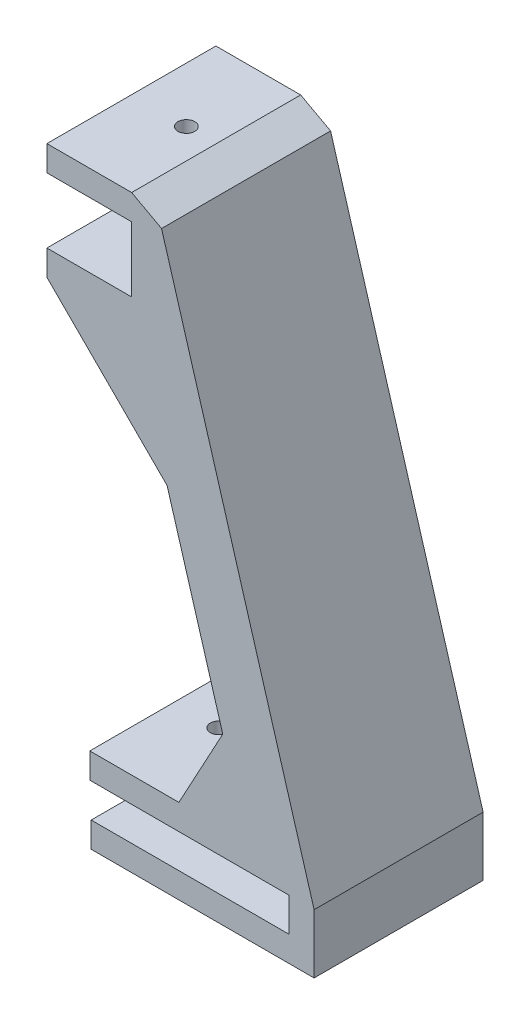
ISO-10303-21;
HEADER;
FILE_DESCRIPTION(('STEP AP214'),'2;1');
FILE_NAME('part.step','',(''),(''),'','','');
FILE_SCHEMA(('AUTOMOTIVE_DESIGN { 1 0 10303 214 1 1 1 1 }'));
ENDSEC;
DATA;
#1=APPLICATION_CONTEXT('core data for automotive mechanical design processes');
#2=APPLICATION_PROTOCOL_DEFINITION('international standard','automotive_design',2000,#1);
#3=PRODUCT_CONTEXT('',#1,'mechanical');
#4=PRODUCT('Part','Part','',(#3));
#5=PRODUCT_RELATED_PRODUCT_CATEGORY('part','',(#4));
#6=PRODUCT_DEFINITION_FORMATION('','',#4);
#7=PRODUCT_DEFINITION_CONTEXT('part definition',#1,'design');
#8=PRODUCT_DEFINITION('design','',#6,#7);
#9=PRODUCT_DEFINITION_SHAPE('','',#8);
#10=(LENGTH_UNIT() NAMED_UNIT(*) SI_UNIT(.MILLI.,.METRE.));
#11=(NAMED_UNIT(*) PLANE_ANGLE_UNIT() SI_UNIT($,.RADIAN.));
#12=(NAMED_UNIT(*) SI_UNIT($,.STERADIAN.) SOLID_ANGLE_UNIT());
#13=UNCERTAINTY_MEASURE_WITH_UNIT(LENGTH_MEASURE(1.E-05),#10,'distance_accuracy_value','');
#14=(GEOMETRIC_REPRESENTATION_CONTEXT(3) GLOBAL_UNCERTAINTY_ASSIGNED_CONTEXT((#13)) GLOBAL_UNIT_ASSIGNED_CONTEXT((#10,
#11,#12)) REPRESENTATION_CONTEXT('',''));
#15=CARTESIAN_POINT('',(0.,0.,0.));
#16=DIRECTION('',(0.,0.,1.));
#17=DIRECTION('',(1.,0.,0.));
#18=AXIS2_PLACEMENT_3D('',#15,#16,#17);
#19=CARTESIAN_POINT('',(0.,0.,20.));
#20=DIRECTION('',(1.,0.,0.));
#21=DIRECTION('',(0.,1.,0.));
#22=AXIS2_PLACEMENT_3D('',#19,#20,#21);
#23=PLANE('',#22);
#24=DIRECTION('',(0.,-1.,0.));
#25=VECTOR('',#24,1.);
#26=CARTESIAN_POINT('',(0.,0.,0.));
#27=LINE('',#26,#25);
#28=CARTESIAN_POINT('',(0.,0.,0.));
#29=VERTEX_POINT('',#28);
#30=CARTESIAN_POINT('',(0.,-3.,0.));
#31=VERTEX_POINT('',#30);
#32=EDGE_CURVE('E187',#29,#31,#27,.T.);
#33=ORIENTED_EDGE('',*,*,#32,.T.);
#34=DIRECTION('',(0.,0.,-1.));
#35=VECTOR('',#34,1.);
#36=CARTESIAN_POINT('',(0.,-3.,20.));
#37=LINE('',#36,#35);
#38=CARTESIAN_POINT('',(0.,-3.,20.));
#39=VERTEX_POINT('',#38);
#40=EDGE_CURVE('E168',#39,#31,#37,.T.);
#41=ORIENTED_EDGE('',*,*,#40,.F.);
#42=DIRECTION('',(0.,-1.,0.));
#43=VECTOR('',#42,1.);
#44=CARTESIAN_POINT('',(0.,0.,20.));
#45=LINE('',#44,#43);
#46=CARTESIAN_POINT('',(0.,0.,20.));
#47=VERTEX_POINT('',#46);
#48=EDGE_CURVE('E175',#47,#39,#45,.T.);
#49=ORIENTED_EDGE('',*,*,#48,.F.);
#50=DIRECTION('',(0.,0.,-1.));
#51=VECTOR('',#50,1.);
#52=CARTESIAN_POINT('',(0.,0.,20.));
#53=LINE('',#52,#51);
#54=EDGE_CURVE('E264',#47,#29,#53,.T.);
#55=ORIENTED_EDGE('',*,*,#54,.T.);
#56=EDGE_LOOP('',(#33,#41,#49,#55));
#57=FACE_BOUND('',#56,.T.);
#58=ADVANCED_FACE('F33',(#57),#23,.F.);
#59=CARTESIAN_POINT('',(0.,-3.,20.));
#60=DIRECTION('',(0.,1.,0.));
#61=DIRECTION('',(0.,0.,1.));
#62=AXIS2_PLACEMENT_3D('',#59,#60,#61);
#63=PLANE('',#62);
#64=CARTESIAN_POINT('',(5.10406737319468,-3.,10.));
#65=DIRECTION('',(0.,1.,0.));
#66=DIRECTION('',(0.,0.,1.));
#67=AXIS2_PLACEMENT_3D('',#64,#65,#66);
#68=CIRCLE('',#67,1.);
#69=CARTESIAN_POINT('',(5.10406737319468,-3.,11.));
#70=VERTEX_POINT('',#69);
#71=EDGE_CURVE('E336',#70,#70,#68,.T.);
#72=ORIENTED_EDGE('',*,*,#71,.T.);
#73=EDGE_LOOP('',(#72));
#74=FACE_BOUND('',#73,.T.);
#75=DIRECTION('',(1.,0.,0.));
#76=VECTOR('',#75,1.);
#77=CARTESIAN_POINT('',(0.,-3.,0.));
#78=LINE('',#77,#76);
#79=CARTESIAN_POINT('',(26.3770268734246,-3.,0.));
#80=VERTEX_POINT('',#79);
#81=EDGE_CURVE('E300',#31,#80,#78,.T.);
#82=ORIENTED_EDGE('',*,*,#81,.T.);
#83=DIRECTION('',(0.,0.,-1.));
#84=VECTOR('',#83,1.);
#85=CARTESIAN_POINT('',(26.3770268734246,-3.,20.));
#86=LINE('',#85,#84);
#87=CARTESIAN_POINT('',(26.3770268734246,-3.,20.));
#88=VERTEX_POINT('',#87);
#89=EDGE_CURVE('E171',#88,#80,#86,.T.);
#90=ORIENTED_EDGE('',*,*,#89,.F.);
#91=DIRECTION('',(1.,0.,0.));
#92=VECTOR('',#91,1.);
#93=CARTESIAN_POINT('',(0.,-3.,20.));
#94=LINE('',#93,#92);
#95=EDGE_CURVE('E164',#39,#88,#94,.T.);
#96=ORIENTED_EDGE('',*,*,#95,.F.);
#97=ORIENTED_EDGE('',*,*,#40,.T.);
#98=EDGE_LOOP('',(#82,#90,#96,#97));
#99=FACE_BOUND('',#98,.T.);
#100=ADVANCED_FACE('F166',(#74,#99),#63,.F.);
#101=CARTESIAN_POINT('',(26.3770268734246,-3.,20.));
#102=DIRECTION('',(-1.,0.,0.));
#103=DIRECTION('',(0.,0.,1.));
#104=AXIS2_PLACEMENT_3D('',#101,#102,#103);
#105=PLANE('',#104);
#106=DIRECTION('',(0.,1.,0.));
#107=VECTOR('',#106,1.);
#108=CARTESIAN_POINT('',(26.3770268734246,-3.,0.));
#109=LINE('',#108,#107);
#110=CARTESIAN_POINT('',(26.3770268734246,4.,0.));
#111=VERTEX_POINT('',#110);
#112=EDGE_CURVE('E240',#80,#111,#109,.T.);
#113=ORIENTED_EDGE('',*,*,#112,.T.);
#114=DIRECTION('',(0.,0.,-1.));
#115=VECTOR('',#114,1.);
#116=CARTESIAN_POINT('',(26.3770268734246,4.,20.));
#117=LINE('',#116,#115);
#118=CARTESIAN_POINT('',(26.3770268734246,4.,20.));
#119=VERTEX_POINT('',#118);
#120=EDGE_CURVE('E192',#119,#111,#117,.T.);
#121=ORIENTED_EDGE('',*,*,#120,.F.);
#122=DIRECTION('',(0.,1.,0.));
#123=VECTOR('',#122,1.);
#124=CARTESIAN_POINT('',(26.3770268734246,-3.,20.));
#125=LINE('',#124,#123);
#126=EDGE_CURVE('E174',#88,#119,#125,.T.);
#127=ORIENTED_EDGE('',*,*,#126,.F.);
#128=ORIENTED_EDGE('',*,*,#89,.T.);
#129=EDGE_LOOP('',(#113,#121,#127,#128));
#130=FACE_BOUND('',#129,.T.);
#131=ADVANCED_FACE('F404',(#130),#105,.F.);
#132=CARTESIAN_POINT('',(26.3770268734246,4.,20.));
#133=DIRECTION('',(-0.958616372585983,-0.284700983858665,0.));
#134=DIRECTION('',(0.284700983858665,-0.958616372585983,0.));
#135=AXIS2_PLACEMENT_3D('',#132,#133,#134);
#136=PLANE('',#135);
#137=DIRECTION('',(-0.284700983858665,0.958616372585983,0.));
#138=VECTOR('',#137,1.);
#139=CARTESIAN_POINT('',(26.3770268734246,4.,0.));
#140=LINE('',#139,#138);
#141=CARTESIAN_POINT('',(8.32505724930927,64.782767254828,0.));
#142=VERTEX_POINT('',#141);
#143=EDGE_CURVE('E236',#111,#142,#140,.T.);
#144=ORIENTED_EDGE('',*,*,#143,.T.);
#145=DIRECTION('',(0.,0.,1.));
#146=VECTOR('',#145,1.);
#147=CARTESIAN_POINT('',(8.32505724930927,64.782767254828,20.));
#148=LINE('',#147,#146);
#149=CARTESIAN_POINT('',(8.32505724930927,64.782767254828,20.));
#150=VERTEX_POINT('',#149);
#151=EDGE_CURVE('E41',#142,#150,#148,.T.);
#152=ORIENTED_EDGE('',*,*,#151,.T.);
#153=DIRECTION('',(-0.284700983858665,0.958616372585983,0.));
#154=VECTOR('',#153,1.);
#155=CARTESIAN_POINT('',(26.3770268734246,4.,20.));
#156=LINE('',#155,#154);
#157=EDGE_CURVE('E297',#119,#150,#156,.T.);
#158=ORIENTED_EDGE('',*,*,#157,.F.);
#159=ORIENTED_EDGE('',*,*,#120,.T.);
#160=EDGE_LOOP('',(#144,#152,#158,#159));
#161=FACE_BOUND('',#160,.T.);
#162=ADVANCED_FACE('F296',(#161),#136,.F.);
#163=CARTESIAN_POINT('',(7.75565528159194,66.7,20.));
#164=DIRECTION('',(0.,-1.,0.));
#165=DIRECTION('',(0.,0.,-1.));
#166=AXIS2_PLACEMENT_3D('',#163,#164,#165);
#167=PLANE('',#166);
#168=CARTESIAN_POINT('',(1.25565528159194,66.7,10.));
#169=DIRECTION('',(0.,1.,0.));
#170=DIRECTION('',(0.,0.,1.));
#171=AXIS2_PLACEMENT_3D('',#168,#169,#170);
#172=CIRCLE('',#171,1.);
#173=CARTESIAN_POINT('',(1.25565528159194,66.7,11.));
#174=VERTEX_POINT('',#173);
#175=EDGE_CURVE('E214',#174,#174,#172,.T.);
#176=ORIENTED_EDGE('',*,*,#175,.F.);
#177=EDGE_LOOP('',(#176));
#178=FACE_BOUND('',#177,.T.);
#179=DIRECTION('',(-1.,0.,0.));
#180=VECTOR('',#179,1.);
#181=CARTESIAN_POINT('',(7.75565528159194,66.7,20.));
#182=LINE('',#181,#180);
#183=CARTESIAN_POINT('',(4.78792367395351,66.7,20.));
#184=VERTEX_POINT('',#183);
#185=CARTESIAN_POINT('',(-5.24434471840806,66.7,20.));
#186=VERTEX_POINT('',#185);
#187=EDGE_CURVE('E229',#184,#186,#182,.T.);
#188=ORIENTED_EDGE('',*,*,#187,.F.);
#189=DIRECTION('',(0.,0.,-1.));
#190=VECTOR('',#189,1.);
#191=CARTESIAN_POINT('',(4.78792367395351,66.7,20.));
#192=LINE('',#191,#190);
#193=CARTESIAN_POINT('',(4.78792367395351,66.7,0.));
#194=VERTEX_POINT('',#193);
#195=EDGE_CURVE('E209',#184,#194,#192,.T.);
#196=ORIENTED_EDGE('',*,*,#195,.T.);
#197=DIRECTION('',(-1.,0.,0.));
#198=VECTOR('',#197,1.);
#199=CARTESIAN_POINT('',(7.75565528159194,66.7,0.));
#200=LINE('',#199,#198);
#201=CARTESIAN_POINT('',(-5.24434471840806,66.7,0.));
#202=VERTEX_POINT('',#201);
#203=EDGE_CURVE('E227',#194,#202,#200,.T.);
#204=ORIENTED_EDGE('',*,*,#203,.T.);
#205=DIRECTION('',(0.,0.,-1.));
#206=VECTOR('',#205,1.);
#207=CARTESIAN_POINT('',(-5.24434471840806,66.7,20.));
#208=LINE('',#207,#206);
#209=EDGE_CURVE('E293',#186,#202,#208,.T.);
#210=ORIENTED_EDGE('',*,*,#209,.F.);
#211=EDGE_LOOP('',(#188,#196,#204,#210));
#212=FACE_BOUND('',#211,.T.);
#213=ADVANCED_FACE('F225',(#178,#212),#167,.F.);
#214=CARTESIAN_POINT('',(-5.24434471840806,66.7,20.));
#215=DIRECTION('',(1.,0.,0.));
#216=DIRECTION('',(0.,0.,-1.));
#217=AXIS2_PLACEMENT_3D('',#214,#215,#216);
#218=PLANE('',#217);
#219=DIRECTION('',(0.,-1.,0.));
#220=VECTOR('',#219,1.);
#221=CARTESIAN_POINT('',(-5.24434471840806,66.7,0.));
#222=LINE('',#221,#220);
#223=CARTESIAN_POINT('',(-5.24434471840806,63.7,0.));
#224=VERTEX_POINT('',#223);
#225=EDGE_CURVE('E235',#202,#224,#222,.T.);
#226=ORIENTED_EDGE('',*,*,#225,.T.);
#227=DIRECTION('',(0.,0.,-1.));
#228=VECTOR('',#227,1.);
#229=CARTESIAN_POINT('',(-5.24434471840806,63.7,20.));
#230=LINE('',#229,#228);
#231=CARTESIAN_POINT('',(-5.24434471840806,63.7,20.));
#232=VERTEX_POINT('',#231);
#233=EDGE_CURVE('E290',#232,#224,#230,.T.);
#234=ORIENTED_EDGE('',*,*,#233,.F.);
#235=DIRECTION('',(0.,-1.,0.));
#236=VECTOR('',#235,1.);
#237=CARTESIAN_POINT('',(-5.24434471840806,66.7,20.));
#238=LINE('',#237,#236);
#239=EDGE_CURVE('E325',#186,#232,#238,.T.);
#240=ORIENTED_EDGE('',*,*,#239,.F.);
#241=ORIENTED_EDGE('',*,*,#209,.T.);
#242=EDGE_LOOP('',(#226,#234,#240,#241));
#243=FACE_BOUND('',#242,.T.);
#244=ADVANCED_FACE('F392',(#243),#218,.F.);
#245=CARTESIAN_POINT('',(-5.24434471840806,63.7,20.));
#246=DIRECTION('',(0.,1.,0.));
#247=DIRECTION('',(0.,0.,1.));
#248=AXIS2_PLACEMENT_3D('',#245,#246,#247);
#249=PLANE('',#248);
#250=CARTESIAN_POINT('',(1.25565528159194,63.7,10.));
#251=DIRECTION('',(0.,1.,0.));
#252=DIRECTION('',(0.,0.,1.));
#253=AXIS2_PLACEMENT_3D('',#250,#251,#252);
#254=CIRCLE('',#253,1.);
#255=CARTESIAN_POINT('',(1.25565528159194,63.7,11.));
#256=VERTEX_POINT('',#255);
#257=EDGE_CURVE('E304',#256,#256,#254,.T.);
#258=ORIENTED_EDGE('',*,*,#257,.T.);
#259=EDGE_LOOP('',(#258));
#260=FACE_BOUND('',#259,.T.);
#261=DIRECTION('',(1.,0.,0.));
#262=VECTOR('',#261,1.);
#263=CARTESIAN_POINT('',(-5.24434471840806,63.7,0.));
#264=LINE('',#263,#262);
#265=CARTESIAN_POINT('',(4.75565528159194,63.7,0.));
#266=VERTEX_POINT('',#265);
#267=EDGE_CURVE('E238',#224,#266,#264,.T.);
#268=ORIENTED_EDGE('',*,*,#267,.T.);
#269=DIRECTION('',(0.,0.,-1.));
#270=VECTOR('',#269,1.);
#271=CARTESIAN_POINT('',(4.75565528159194,63.7,20.));
#272=LINE('',#271,#270);
#273=CARTESIAN_POINT('',(4.75565528159194,63.7,20.));
#274=VERTEX_POINT('',#273);
#275=EDGE_CURVE('E287',#274,#266,#272,.T.);
#276=ORIENTED_EDGE('',*,*,#275,.F.);
#277=DIRECTION('',(1.,0.,0.));
#278=VECTOR('',#277,1.);
#279=CARTESIAN_POINT('',(-5.24434471840806,63.7,20.));
#280=LINE('',#279,#278);
#281=EDGE_CURVE('E323',#232,#274,#280,.T.);
#282=ORIENTED_EDGE('',*,*,#281,.F.);
#283=ORIENTED_EDGE('',*,*,#233,.T.);
#284=EDGE_LOOP('',(#268,#276,#282,#283));
#285=FACE_BOUND('',#284,.T.);
#286=ADVANCED_FACE('F388',(#260,#285),#249,.F.);
#287=CARTESIAN_POINT('',(4.75565528159194,63.7,20.));
#288=DIRECTION('',(1.,0.,0.));
#289=DIRECTION('',(0.,1.,0.));
#290=AXIS2_PLACEMENT_3D('',#287,#288,#289);
#291=PLANE('',#290);
#292=DIRECTION('',(0.,-1.,0.));
#293=VECTOR('',#292,1.);
#294=CARTESIAN_POINT('',(4.75565528159194,63.7,0.));
#295=LINE('',#294,#293);
#296=CARTESIAN_POINT('',(4.75565528159194,56.,0.));
#297=VERTEX_POINT('',#296);
#298=EDGE_CURVE('E245',#266,#297,#295,.T.);
#299=ORIENTED_EDGE('',*,*,#298,.T.);
#300=DIRECTION('',(0.,0.,-1.));
#301=VECTOR('',#300,1.);
#302=CARTESIAN_POINT('',(4.75565528159194,56.,20.));
#303=LINE('',#302,#301);
#304=CARTESIAN_POINT('',(4.75565528159194,56.,20.));
#305=VERTEX_POINT('',#304);
#306=EDGE_CURVE('E284',#305,#297,#303,.T.);
#307=ORIENTED_EDGE('',*,*,#306,.F.);
#308=DIRECTION('',(0.,-1.,0.));
#309=VECTOR('',#308,1.);
#310=CARTESIAN_POINT('',(4.75565528159194,63.7,20.));
#311=LINE('',#310,#309);
#312=EDGE_CURVE('E321',#274,#305,#311,.T.);
#313=ORIENTED_EDGE('',*,*,#312,.F.);
#314=ORIENTED_EDGE('',*,*,#275,.T.);
#315=EDGE_LOOP('',(#299,#307,#313,#314));
#316=FACE_BOUND('',#315,.T.);
#317=ADVANCED_FACE('F383',(#316),#291,.F.);
#318=CARTESIAN_POINT('',(4.75565528159194,56.,20.));
#319=DIRECTION('',(0.,-1.,0.));
#320=DIRECTION('',(0.,0.,-1.));
#321=AXIS2_PLACEMENT_3D('',#318,#319,#320);
#322=PLANE('',#321);
#323=CARTESIAN_POINT('',(1.25565528159194,56.,10.));
#324=DIRECTION('',(0.,-1.,0.));
#325=DIRECTION('',(0.,0.,-1.));
#326=AXIS2_PLACEMENT_3D('',#323,#324,#325);
#327=CIRCLE('',#326,1.);
#328=CARTESIAN_POINT('',(1.25565528159194,56.,9.));
#329=VERTEX_POINT('',#328);
#330=EDGE_CURVE('E213',#329,#329,#327,.T.);
#331=ORIENTED_EDGE('',*,*,#330,.T.);
#332=EDGE_LOOP('',(#331));
#333=FACE_BOUND('',#332,.T.);
#334=DIRECTION('',(-1.,0.,0.));
#335=VECTOR('',#334,1.);
#336=CARTESIAN_POINT('',(4.75565528159194,56.,0.));
#337=LINE('',#336,#335);
#338=CARTESIAN_POINT('',(-5.24434471840806,56.,0.));
#339=VERTEX_POINT('',#338);
#340=EDGE_CURVE('E247',#297,#339,#337,.T.);
#341=ORIENTED_EDGE('',*,*,#340,.T.);
#342=DIRECTION('',(0.,0.,-1.));
#343=VECTOR('',#342,1.);
#344=CARTESIAN_POINT('',(-5.24434471840806,56.,20.));
#345=LINE('',#344,#343);
#346=CARTESIAN_POINT('',(-5.24434471840806,56.,20.));
#347=VERTEX_POINT('',#346);
#348=EDGE_CURVE('E281',#347,#339,#345,.T.);
#349=ORIENTED_EDGE('',*,*,#348,.F.);
#350=DIRECTION('',(-1.,0.,0.));
#351=VECTOR('',#350,1.);
#352=CARTESIAN_POINT('',(4.75565528159194,56.,20.));
#353=LINE('',#352,#351);
#354=EDGE_CURVE('E319',#305,#347,#353,.T.);
#355=ORIENTED_EDGE('',*,*,#354,.F.);
#356=ORIENTED_EDGE('',*,*,#306,.T.);
#357=EDGE_LOOP('',(#341,#349,#355,#356));
#358=FACE_BOUND('',#357,.T.);
#359=ADVANCED_FACE('F379',(#333,#358),#322,.F.);
#360=CARTESIAN_POINT('',(-5.24434471840806,56.,20.));
#361=DIRECTION('',(1.,0.,0.));
#362=DIRECTION('',(0.,0.,-1.));
#363=AXIS2_PLACEMENT_3D('',#360,#361,#362);
#364=PLANE('',#363);
#365=DIRECTION('',(0.,-1.,0.));
#366=VECTOR('',#365,1.);
#367=CARTESIAN_POINT('',(-5.24434471840806,56.,0.));
#368=LINE('',#367,#366);
#369=CARTESIAN_POINT('',(-5.24434471840806,53.,0.));
#370=VERTEX_POINT('',#369);
#371=EDGE_CURVE('E249',#339,#370,#368,.T.);
#372=ORIENTED_EDGE('',*,*,#371,.T.);
#373=DIRECTION('',(0.,0.,-1.));
#374=VECTOR('',#373,1.);
#375=CARTESIAN_POINT('',(-5.24434471840806,53.,20.));
#376=LINE('',#375,#374);
#377=CARTESIAN_POINT('',(-5.24434471840806,53.,20.));
#378=VERTEX_POINT('',#377);
#379=EDGE_CURVE('E278',#378,#370,#376,.T.);
#380=ORIENTED_EDGE('',*,*,#379,.F.);
#381=DIRECTION('',(0.,-1.,0.));
#382=VECTOR('',#381,1.);
#383=CARTESIAN_POINT('',(-5.24434471840806,56.,20.));
#384=LINE('',#383,#382);
#385=EDGE_CURVE('E317',#347,#378,#384,.T.);
#386=ORIENTED_EDGE('',*,*,#385,.F.);
#387=ORIENTED_EDGE('',*,*,#348,.T.);
#388=EDGE_LOOP('',(#372,#380,#386,#387));
#389=FACE_BOUND('',#388,.T.);
#390=ADVANCED_FACE('F374',(#389),#364,.F.);
#391=CARTESIAN_POINT('',(4.75565528159194,53.,20.));
#392=DIRECTION('',(0.958616372585983,0.284700983858665,0.));
#393=DIRECTION('',(-0.284700983858665,0.958616372585983,0.));
#394=AXIS2_PLACEMENT_3D('',#391,#392,#393);
#395=PLANE('',#394);
#396=DIRECTION('',(0.284700983858665,-0.958616372585983,0.));
#397=VECTOR('',#396,1.);
#398=CARTESIAN_POINT('',(4.75565528159194,53.,20.));
#399=LINE('',#398,#397);
#400=CARTESIAN_POINT('',(8.98023582420759,38.7754194573842,20.));
#401=VERTEX_POINT('',#400);
#402=CARTESIAN_POINT('',(15.5702577751314,16.5861637258598,20.));
#403=VERTEX_POINT('',#402);
#404=EDGE_CURVE('E314',#401,#403,#399,.T.);
#405=ORIENTED_EDGE('',*,*,#404,.F.);
#406=DIRECTION('',(0.,0.,-1.));
#407=VECTOR('',#406,1.);
#408=CARTESIAN_POINT('',(8.98023582420759,38.7754194573842,0.));
#409=LINE('',#408,#407);
#410=CARTESIAN_POINT('',(8.98023582420759,38.7754194573842,0.));
#411=VERTEX_POINT('',#410);
#412=EDGE_CURVE('E190',#401,#411,#409,.T.);
#413=ORIENTED_EDGE('',*,*,#412,.T.);
#414=DIRECTION('',(0.284700983858665,-0.958616372585983,0.));
#415=VECTOR('',#414,1.);
#416=CARTESIAN_POINT('',(4.75565528159194,53.,0.));
#417=LINE('',#416,#415);
#418=CARTESIAN_POINT('',(15.5702577751314,16.5861637258598,0.));
#419=VERTEX_POINT('',#418);
#420=EDGE_CURVE('E252',#411,#419,#417,.T.);
#421=ORIENTED_EDGE('',*,*,#420,.T.);
#422=DIRECTION('',(0.,0.,1.));
#423=VECTOR('',#422,1.);
#424=CARTESIAN_POINT('',(15.5702577751314,16.5861637258598,20.));
#425=LINE('',#424,#423);
#426=EDGE_CURVE('E188',#419,#403,#425,.T.);
#427=ORIENTED_EDGE('',*,*,#426,.T.);
#428=EDGE_LOOP('',(#405,#413,#421,#427));
#429=FACE_BOUND('',#428,.T.);
#430=ADVANCED_FACE('F351',(#429),#395,.F.);
#431=CARTESIAN_POINT('',(4.75565528159195,7.,20.));
#432=DIRECTION('',(0.,-1.,0.));
#433=DIRECTION('',(1.,0.,0.));
#434=AXIS2_PLACEMENT_3D('',#431,#432,#433);
#435=PLANE('',#434);
#436=CARTESIAN_POINT('',(5.10406737319469,7.,10.));
#437=DIRECTION('',(0.,1.,0.));
#438=DIRECTION('',(-1.,0.,0.));
#439=AXIS2_PLACEMENT_3D('',#436,#437,#438);
#440=CIRCLE('',#439,1.);
#441=CARTESIAN_POINT('',(4.10406737319469,7.,10.));
#442=VERTEX_POINT('',#441);
#443=EDGE_CURVE('E219',#442,#442,#440,.T.);
#444=ORIENTED_EDGE('',*,*,#443,.F.);
#445=EDGE_LOOP('',(#444));
#446=FACE_BOUND('',#445,.T.);
#447=DIRECTION('',(-1.,0.,0.));
#448=VECTOR('',#447,1.);
#449=CARTESIAN_POINT('',(18.417267613718,7.,20.));
#450=LINE('',#449,#448);
#451=CARTESIAN_POINT('',(10.3742688184661,7.,20.));
#452=VERTEX_POINT('',#451);
#453=CARTESIAN_POINT('',(-0.16613407207676,7.,20.));
#454=VERTEX_POINT('',#453);
#455=EDGE_CURVE('E312',#452,#454,#450,.T.);
#456=ORIENTED_EDGE('',*,*,#455,.F.);
#457=DIRECTION('',(0.,0.,-1.));
#458=VECTOR('',#457,1.);
#459=CARTESIAN_POINT('',(10.3742688184661,7.,0.));
#460=LINE('',#459,#458);
#461=CARTESIAN_POINT('',(10.3742688184661,7.,0.));
#462=VERTEX_POINT('',#461);
#463=EDGE_CURVE('E198',#452,#462,#460,.T.);
#464=ORIENTED_EDGE('',*,*,#463,.T.);
#465=DIRECTION('',(-1.,0.,0.));
#466=VECTOR('',#465,1.);
#467=CARTESIAN_POINT('',(4.75565528159195,7.,0.));
#468=LINE('',#467,#466);
#469=CARTESIAN_POINT('',(-0.16613407207676,7.,0.));
#470=VERTEX_POINT('',#469);
#471=EDGE_CURVE('E255',#462,#470,#468,.T.);
#472=ORIENTED_EDGE('',*,*,#471,.T.);
#473=DIRECTION('',(0.,0.,-1.));
#474=VECTOR('',#473,1.);
#475=CARTESIAN_POINT('',(-0.16613407207676,7.,20.));
#476=LINE('',#475,#474);
#477=EDGE_CURVE('E275',#454,#470,#476,.T.);
#478=ORIENTED_EDGE('',*,*,#477,.F.);
#479=EDGE_LOOP('',(#456,#464,#472,#478));
#480=FACE_BOUND('',#479,.T.);
#481=ADVANCED_FACE('F347',(#446,#480),#435,.F.);
#482=CARTESIAN_POINT('',(-0.16613407207676,7.,20.));
#483=DIRECTION('',(1.,0.,0.));
#484=DIRECTION('',(0.,1.,0.));
#485=AXIS2_PLACEMENT_3D('',#482,#483,#484);
#486=PLANE('',#485);
#487=DIRECTION('',(0.,-1.,0.));
#488=VECTOR('',#487,1.);
#489=CARTESIAN_POINT('',(-0.16613407207676,7.,0.));
#490=LINE('',#489,#488);
#491=CARTESIAN_POINT('',(-0.166134072076759,4.,0.));
#492=VERTEX_POINT('',#491);
#493=EDGE_CURVE('E257',#470,#492,#490,.T.);
#494=ORIENTED_EDGE('',*,*,#493,.T.);
#495=DIRECTION('',(0.,0.,-1.));
#496=VECTOR('',#495,1.);
#497=CARTESIAN_POINT('',(-0.166134072076759,4.,20.));
#498=LINE('',#497,#496);
#499=CARTESIAN_POINT('',(-0.166134072076759,4.,20.));
#500=VERTEX_POINT('',#499);
#501=EDGE_CURVE('E272',#500,#492,#498,.T.);
#502=ORIENTED_EDGE('',*,*,#501,.F.);
#503=DIRECTION('',(0.,-1.,0.));
#504=VECTOR('',#503,1.);
#505=CARTESIAN_POINT('',(-0.16613407207676,7.,20.));
#506=LINE('',#505,#504);
#507=EDGE_CURVE('E310',#454,#500,#506,.T.);
#508=ORIENTED_EDGE('',*,*,#507,.F.);
#509=ORIENTED_EDGE('',*,*,#477,.T.);
#510=EDGE_LOOP('',(#494,#502,#508,#509));
#511=FACE_BOUND('',#510,.T.);
#512=ADVANCED_FACE('F350',(#511),#486,.F.);
#513=CARTESIAN_POINT('',(23.3770268734246,4.,20.));
#514=DIRECTION('',(0.,1.,0.));
#515=DIRECTION('',(0.,0.,1.));
#516=AXIS2_PLACEMENT_3D('',#513,#514,#515);
#517=PLANE('',#516);
#518=CARTESIAN_POINT('',(5.10406737319469,4.,10.));
#519=DIRECTION('',(0.,1.,0.));
#520=DIRECTION('',(0.,0.,1.));
#521=AXIS2_PLACEMENT_3D('',#518,#519,#520);
#522=CIRCLE('',#521,1.);
#523=CARTESIAN_POINT('',(5.10406737319469,4.,11.));
#524=VERTEX_POINT('',#523);
#525=EDGE_CURVE('E218',#524,#524,#522,.T.);
#526=ORIENTED_EDGE('',*,*,#525,.T.);
#527=EDGE_LOOP('',(#526));
#528=FACE_BOUND('',#527,.T.);
#529=DIRECTION('',(1.,0.,0.));
#530=VECTOR('',#529,1.);
#531=CARTESIAN_POINT('',(23.3770268734246,4.,0.));
#532=LINE('',#531,#530);
#533=CARTESIAN_POINT('',(23.3770268734246,4.,0.));
#534=VERTEX_POINT('',#533);
#535=EDGE_CURVE('E259',#492,#534,#532,.T.);
#536=ORIENTED_EDGE('',*,*,#535,.T.);
#537=DIRECTION('',(0.,0.,-1.));
#538=VECTOR('',#537,1.);
#539=CARTESIAN_POINT('',(23.3770268734246,4.,20.));
#540=LINE('',#539,#538);
#541=CARTESIAN_POINT('',(23.3770268734246,4.,20.));
#542=VERTEX_POINT('',#541);
#543=EDGE_CURVE('E269',#542,#534,#540,.T.);
#544=ORIENTED_EDGE('',*,*,#543,.F.);
#545=DIRECTION('',(1.,0.,0.));
#546=VECTOR('',#545,1.);
#547=CARTESIAN_POINT('',(23.3770268734246,4.,20.));
#548=LINE('',#547,#546);
#549=EDGE_CURVE('E308',#500,#542,#548,.T.);
#550=ORIENTED_EDGE('',*,*,#549,.F.);
#551=ORIENTED_EDGE('',*,*,#501,.T.);
#552=EDGE_LOOP('',(#536,#544,#550,#551));
#553=FACE_BOUND('',#552,.T.);
#554=ADVANCED_FACE('F437',(#528,#553),#517,.F.);
#555=CARTESIAN_POINT('',(23.3770268734246,0.,20.));
#556=DIRECTION('',(1.,0.,0.));
#557=DIRECTION('',(0.,0.,-1.));
#558=AXIS2_PLACEMENT_3D('',#555,#556,#557);
#559=PLANE('',#558);
#560=DIRECTION('',(0.,-1.,0.));
#561=VECTOR('',#560,1.);
#562=CARTESIAN_POINT('',(23.3770268734246,0.,0.));
#563=LINE('',#562,#561);
#564=CARTESIAN_POINT('',(23.3770268734246,0.,0.));
#565=VERTEX_POINT('',#564);
#566=EDGE_CURVE('E261',#534,#565,#563,.T.);
#567=ORIENTED_EDGE('',*,*,#566,.T.);
#568=DIRECTION('',(0.,0.,-1.));
#569=VECTOR('',#568,1.);
#570=CARTESIAN_POINT('',(23.3770268734246,0.,20.));
#571=LINE('',#570,#569);
#572=CARTESIAN_POINT('',(23.3770268734246,0.,20.));
#573=VERTEX_POINT('',#572);
#574=EDGE_CURVE('E266',#573,#565,#571,.T.);
#575=ORIENTED_EDGE('',*,*,#574,.F.);
#576=DIRECTION('',(0.,-1.,0.));
#577=VECTOR('',#576,1.);
#578=CARTESIAN_POINT('',(23.3770268734246,0.,20.));
#579=LINE('',#578,#577);
#580=EDGE_CURVE('E306',#542,#573,#579,.T.);
#581=ORIENTED_EDGE('',*,*,#580,.F.);
#582=ORIENTED_EDGE('',*,*,#543,.T.);
#583=EDGE_LOOP('',(#567,#575,#581,#582));
#584=FACE_BOUND('',#583,.T.);
#585=ADVANCED_FACE('F433',(#584),#559,.F.);
#586=CARTESIAN_POINT('',(0.,0.,20.));
#587=DIRECTION('',(0.,-1.,0.));
#588=DIRECTION('',(0.,0.,-1.));
#589=AXIS2_PLACEMENT_3D('',#586,#587,#588);
#590=PLANE('',#589);
#591=CARTESIAN_POINT('',(5.10406737319469,0.,10.));
#592=DIRECTION('',(0.,-1.,0.));
#593=DIRECTION('',(0.,0.,-1.));
#594=AXIS2_PLACEMENT_3D('',#591,#592,#593);
#595=CIRCLE('',#594,1.);
#596=CARTESIAN_POINT('',(5.10406737319469,0.,9.));
#597=VERTEX_POINT('',#596);
#598=EDGE_CURVE('E215',#597,#597,#595,.T.);
#599=ORIENTED_EDGE('',*,*,#598,.T.);
#600=EDGE_LOOP('',(#599));
#601=FACE_BOUND('',#600,.T.);
#602=DIRECTION('',(-1.,0.,0.));
#603=VECTOR('',#602,1.);
#604=CARTESIAN_POINT('',(0.,0.,0.));
#605=LINE('',#604,#603);
#606=EDGE_CURVE('E184',#565,#29,#605,.T.);
#607=ORIENTED_EDGE('',*,*,#606,.T.);
#608=ORIENTED_EDGE('',*,*,#54,.F.);
#609=DIRECTION('',(-1.,0.,0.));
#610=VECTOR('',#609,1.);
#611=CARTESIAN_POINT('',(0.,0.,20.));
#612=LINE('',#611,#610);
#613=EDGE_CURVE('E180',#573,#47,#612,.T.);
#614=ORIENTED_EDGE('',*,*,#613,.F.);
#615=ORIENTED_EDGE('',*,*,#574,.T.);
#616=EDGE_LOOP('',(#607,#608,#614,#615));
#617=FACE_BOUND('',#616,.T.);
#618=ADVANCED_FACE('F428',(#601,#617),#590,.F.);
#619=CARTESIAN_POINT('',(0.,0.,20.));
#620=DIRECTION('',(0.,0.,1.));
#621=DIRECTION('',(1.,0.,0.));
#622=AXIS2_PLACEMENT_3D('',#619,#620,#621);
#623=PLANE('',#622);
#624=ORIENTED_EDGE('',*,*,#157,.T.);
#625=DIRECTION('',(0.879158133908941,-0.476530141315057,0.));
#626=VECTOR('',#625,1.);
#627=CARTESIAN_POINT('',(29.0309012098793,53.5595772870492,20.));
#628=LINE('',#627,#626);
#629=EDGE_CURVE('E11',#150,#184,#628,.F.);
#630=ORIENTED_EDGE('',*,*,#629,.T.);
#631=ORIENTED_EDGE('',*,*,#187,.T.);
#632=ORIENTED_EDGE('',*,*,#239,.T.);
#633=ORIENTED_EDGE('',*,*,#281,.T.);
#634=ORIENTED_EDGE('',*,*,#312,.T.);
#635=ORIENTED_EDGE('',*,*,#354,.T.);
#636=ORIENTED_EDGE('',*,*,#385,.T.);
#637=DIRECTION('',(-0.707106781186544,0.707106781186551,0.));
#638=VECTOR('',#637,1.);
#639=CARTESIAN_POINT('',(8.98023582420759,38.7754194573842,20.));
#640=LINE('',#639,#638);
#641=EDGE_CURVE('E203',#378,#401,#640,.F.);
#642=ORIENTED_EDGE('',*,*,#641,.T.);
#643=ORIENTED_EDGE('',*,*,#404,.T.);
#644=DIRECTION('',(0.476530141315058,0.879158133908941,0.));
#645=VECTOR('',#644,1.);
#646=CARTESIAN_POINT('',(10.3742688184661,7.,20.));
#647=LINE('',#646,#645);
#648=EDGE_CURVE('E207',#403,#452,#647,.F.);
#649=ORIENTED_EDGE('',*,*,#648,.T.);
#650=ORIENTED_EDGE('',*,*,#455,.T.);
#651=ORIENTED_EDGE('',*,*,#507,.T.);
#652=ORIENTED_EDGE('',*,*,#549,.T.);
#653=ORIENTED_EDGE('',*,*,#580,.T.);
#654=ORIENTED_EDGE('',*,*,#613,.T.);
#655=ORIENTED_EDGE('',*,*,#48,.T.);
#656=ORIENTED_EDGE('',*,*,#95,.T.);
#657=ORIENTED_EDGE('',*,*,#126,.T.);
#658=EDGE_LOOP('',(#624,#630,#631,#632,#633,#634,#635,#636,#642,#643,#649,#650,#651,#652,#653,
#654,#655,#656,#657));
#659=FACE_BOUND('',#658,.T.);
#660=ADVANCED_FACE('F178',(#659),#623,.T.);
#661=CARTESIAN_POINT('',(0.,0.,0.));
#662=DIRECTION('',(0.,0.,1.));
#663=DIRECTION('',(1.,0.,0.));
#664=AXIS2_PLACEMENT_3D('',#661,#662,#663);
#665=PLANE('',#664);
#666=ORIENTED_EDGE('',*,*,#203,.F.);
#667=DIRECTION('',(-0.879158133908941,0.476530141315057,0.));
#668=VECTOR('',#667,1.);
#669=CARTESIAN_POINT('',(4.78792367395351,66.7,0.));
#670=LINE('',#669,#668);
#671=EDGE_CURVE('E55',#194,#142,#670,.F.);
#672=ORIENTED_EDGE('',*,*,#671,.T.);
#673=ORIENTED_EDGE('',*,*,#143,.F.);
#674=ORIENTED_EDGE('',*,*,#112,.F.);
#675=ORIENTED_EDGE('',*,*,#81,.F.);
#676=ORIENTED_EDGE('',*,*,#32,.F.);
#677=ORIENTED_EDGE('',*,*,#606,.F.);
#678=ORIENTED_EDGE('',*,*,#566,.F.);
#679=ORIENTED_EDGE('',*,*,#535,.F.);
#680=ORIENTED_EDGE('',*,*,#493,.F.);
#681=ORIENTED_EDGE('',*,*,#471,.F.);
#682=DIRECTION('',(-0.476530141315058,-0.879158133908941,0.));
#683=VECTOR('',#682,1.);
#684=CARTESIAN_POINT('',(5.08585228569215,-2.75668484989461,0.));
#685=LINE('',#684,#683);
#686=EDGE_CURVE('E205',#462,#419,#685,.F.);
#687=ORIENTED_EDGE('',*,*,#686,.T.);
#688=ORIENTED_EDGE('',*,*,#420,.F.);
#689=DIRECTION('',(0.707106781186544,-0.707106781186551,0.));
#690=VECTOR('',#689,1.);
#691=CARTESIAN_POINT('',(23.877827640796,23.8778276407957,0.));
#692=LINE('',#691,#690);
#693=EDGE_CURVE('E201',#411,#370,#692,.F.);
#694=ORIENTED_EDGE('',*,*,#693,.T.);
#695=ORIENTED_EDGE('',*,*,#371,.F.);
#696=ORIENTED_EDGE('',*,*,#340,.F.);
#697=ORIENTED_EDGE('',*,*,#298,.F.);
#698=ORIENTED_EDGE('',*,*,#267,.F.);
#699=ORIENTED_EDGE('',*,*,#225,.F.);
#700=EDGE_LOOP('',(#666,#672,#673,#674,#675,#676,#677,#678,#679,#680,#681,#687,#688,#694,#695,
#696,#697,#698,#699));
#701=FACE_BOUND('',#700,.T.);
#702=ADVANCED_FACE('F233',(#701),#665,.F.);
#703=CARTESIAN_POINT('',(8.98023582420759,38.7754194573842,20.));
#704=DIRECTION('',(-0.707106781186551,-0.707106781186544,0.));
#705=DIRECTION('',(0.,0.,1.));
#706=AXIS2_PLACEMENT_3D('',#703,#704,#705);
#707=PLANE('',#706);
#708=CARTESIAN_POINT('',(1.25565528159194,46.5,10.));
#709=DIRECTION('',(-0.707106781186551,-0.707106781186544,0.));
#710=DIRECTION('',(-0.707106781186544,0.707106781186551,0.));
#711=AXIS2_PLACEMENT_3D('',#708,#709,#710);
#712=ELLIPSE('',#711,1.4142135623731,1.);
#713=CARTESIAN_POINT('',(0.25565528159194,47.5,10.));
#714=VERTEX_POINT('',#713);
#715=EDGE_CURVE('E210',#714,#714,#712,.F.);
#716=ORIENTED_EDGE('',*,*,#715,.T.);
#717=EDGE_LOOP('',(#716));
#718=FACE_BOUND('',#717,.T.);
#719=ORIENTED_EDGE('',*,*,#641,.F.);
#720=ORIENTED_EDGE('',*,*,#379,.T.);
#721=ORIENTED_EDGE('',*,*,#693,.F.);
#722=ORIENTED_EDGE('',*,*,#412,.F.);
#723=EDGE_LOOP('',(#719,#720,#721,#722));
#724=FACE_BOUND('',#723,.T.);
#725=ADVANCED_FACE('F369',(#718,#724),#707,.T.);
#726=CARTESIAN_POINT('',(10.3742688184661,7.,20.));
#727=DIRECTION('',(-0.879158133908941,0.476530141315058,0.));
#728=DIRECTION('',(0.,0.,1.));
#729=AXIS2_PLACEMENT_3D('',#726,#727,#728);
#730=PLANE('',#729);
#731=ORIENTED_EDGE('',*,*,#648,.F.);
#732=ORIENTED_EDGE('',*,*,#426,.F.);
#733=ORIENTED_EDGE('',*,*,#686,.F.);
#734=ORIENTED_EDGE('',*,*,#463,.F.);
#735=EDGE_LOOP('',(#731,#732,#733,#734));
#736=FACE_BOUND('',#735,.T.);
#737=ADVANCED_FACE('F360',(#736),#730,.T.);
#738=CARTESIAN_POINT('',(1.25565528159194,44.7,10.));
#739=DIRECTION('',(0.,1.,0.));
#740=DIRECTION('',(0.,0.,1.));
#741=AXIS2_PLACEMENT_3D('',#738,#739,#740);
#742=CYLINDRICAL_SURFACE('',#741,1.);
#743=ORIENTED_EDGE('',*,*,#715,.F.);
#744=EDGE_LOOP('',(#743));
#745=FACE_BOUND('',#744,.T.);
#746=ORIENTED_EDGE('',*,*,#330,.F.);
#747=EDGE_LOOP('',(#746));
#748=FACE_BOUND('',#747,.T.);
#749=ADVANCED_FACE('F412',(#745,#748),#742,.F.);
#750=ORIENTED_EDGE('',*,*,#175,.T.);
#751=EDGE_LOOP('',(#750));
#752=FACE_BOUND('',#751,.T.);
#753=ORIENTED_EDGE('',*,*,#257,.F.);
#754=EDGE_LOOP('',(#753));
#755=FACE_BOUND('',#754,.T.);
#756=ADVANCED_FACE('F416',(#752,#755),#742,.F.);
#757=CARTESIAN_POINT('',(5.10406737319468,-15.,10.));
#758=DIRECTION('',(0.,1.,0.));
#759=DIRECTION('',(-1.,0.,0.));
#760=AXIS2_PLACEMENT_3D('',#757,#758,#759);
#761=CYLINDRICAL_SURFACE('',#760,1.);
#762=ORIENTED_EDGE('',*,*,#598,.F.);
#763=EDGE_LOOP('',(#762));
#764=FACE_BOUND('',#763,.T.);
#765=ORIENTED_EDGE('',*,*,#71,.F.);
#766=EDGE_LOOP('',(#765));
#767=FACE_BOUND('',#766,.T.);
#768=ADVANCED_FACE('F397',(#764,#767),#761,.F.);
#769=ORIENTED_EDGE('',*,*,#443,.T.);
#770=EDGE_LOOP('',(#769));
#771=FACE_BOUND('',#770,.T.);
#772=ORIENTED_EDGE('',*,*,#525,.F.);
#773=EDGE_LOOP('',(#772));
#774=FACE_BOUND('',#773,.T.);
#775=ADVANCED_FACE('F344',(#771,#774),#761,.F.);
#776=CARTESIAN_POINT('',(4.78792367395351,66.7,20.));
#777=DIRECTION('',(-0.476530141315057,-0.879158133908941,0.));
#778=DIRECTION('',(0.,0.,-1.));
#779=AXIS2_PLACEMENT_3D('',#776,#777,#778);
#780=PLANE('',#779);
#781=ORIENTED_EDGE('',*,*,#629,.F.);
#782=ORIENTED_EDGE('',*,*,#151,.F.);
#783=ORIENTED_EDGE('',*,*,#671,.F.);
#784=ORIENTED_EDGE('',*,*,#195,.F.);
#785=EDGE_LOOP('',(#781,#782,#783,#784));
#786=FACE_BOUND('',#785,.T.);
#787=ADVANCED_FACE('F35',(#786),#780,.F.);
#788=CLOSED_SHELL('',(#58,#100,#131,#162,#213,#244,#286,#317,#359,#390,#430,#481,#512,#554,#585,
#618,#660,#702,#725,#737,#749,#756,#768,#775,#787));
#789=MANIFOLD_SOLID_BREP('B2',#788);
#790=ADVANCED_BREP_SHAPE_REPRESENTATION('',(#18,#789),#14);
#791=SHAPE_DEFINITION_REPRESENTATION(#9,#790);
ENDSEC;
END-ISO-10303-21;
